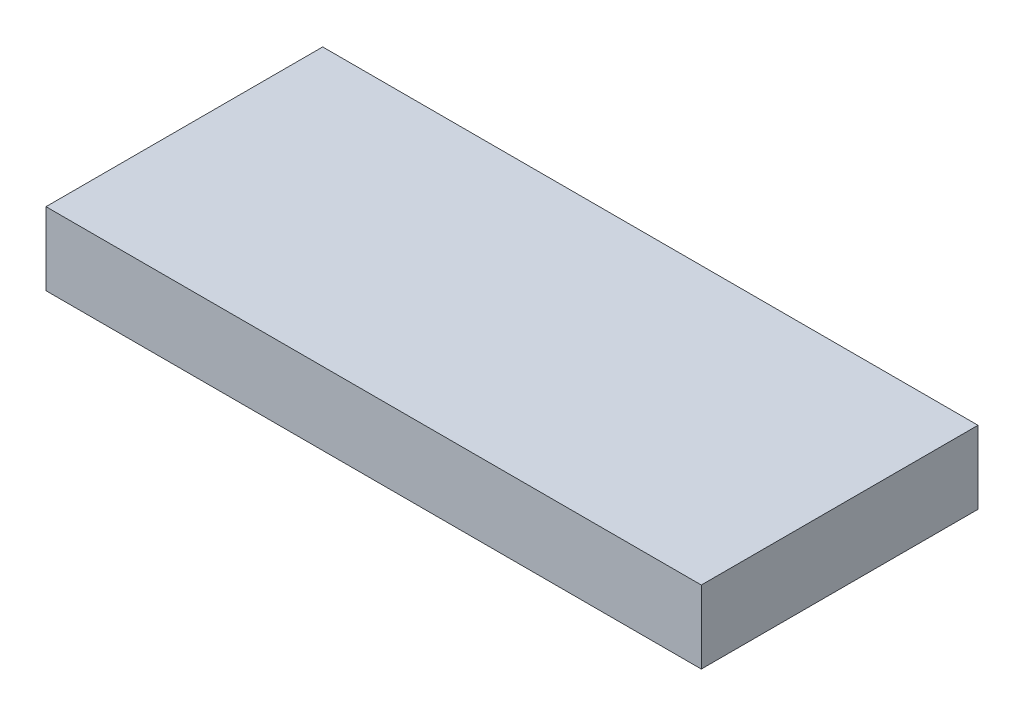
ISO-10303-21;
HEADER;
FILE_DESCRIPTION(('STEP AP214'),'2;1');
FILE_NAME('part.step','',(''),(''),'','','');
FILE_SCHEMA(('AUTOMOTIVE_DESIGN { 1 0 10303 214 1 1 1 1 }'));
ENDSEC;
DATA;
#1=APPLICATION_CONTEXT('core data for automotive mechanical design processes');
#2=APPLICATION_PROTOCOL_DEFINITION('international standard','automotive_design',2000,#1);
#3=PRODUCT_CONTEXT('',#1,'mechanical');
#4=PRODUCT('Part','Part','',(#3));
#5=PRODUCT_RELATED_PRODUCT_CATEGORY('part','',(#4));
#6=PRODUCT_DEFINITION_FORMATION('','',#4);
#7=PRODUCT_DEFINITION_CONTEXT('part definition',#1,'design');
#8=PRODUCT_DEFINITION('design','',#6,#7);
#9=PRODUCT_DEFINITION_SHAPE('','',#8);
#10=(LENGTH_UNIT() NAMED_UNIT(*) SI_UNIT(.MILLI.,.METRE.));
#11=(NAMED_UNIT(*) PLANE_ANGLE_UNIT() SI_UNIT($,.RADIAN.));
#12=(NAMED_UNIT(*) SI_UNIT($,.STERADIAN.) SOLID_ANGLE_UNIT());
#13=UNCERTAINTY_MEASURE_WITH_UNIT(LENGTH_MEASURE(1.E-05),#10,'distance_accuracy_value','');
#14=(GEOMETRIC_REPRESENTATION_CONTEXT(3) GLOBAL_UNCERTAINTY_ASSIGNED_CONTEXT((#13)) GLOBAL_UNIT_ASSIGNED_CONTEXT((#10,
#11,#12)) REPRESENTATION_CONTEXT('',''));
#15=CARTESIAN_POINT('',(0.,0.,0.));
#16=DIRECTION('',(0.,0.,1.));
#17=DIRECTION('',(1.,0.,0.));
#18=AXIS2_PLACEMENT_3D('',#15,#16,#17);
#19=CARTESIAN_POINT('',(0.,6.35,0.));
#20=DIRECTION('',(1.,0.,0.));
#21=DIRECTION('',(0.,0.,-1.));
#22=AXIS2_PLACEMENT_3D('',#19,#20,#21);
#23=PLANE('',#22);
#24=DIRECTION('',(0.,0.,1.));
#25=VECTOR('',#24,1.);
#26=CARTESIAN_POINT('',(0.,0.,0.));
#27=LINE('',#26,#25);
#28=CARTESIAN_POINT('',(0.,0.,0.));
#29=VERTEX_POINT('',#28);
#30=CARTESIAN_POINT('',(0.,0.,24.13));
#31=VERTEX_POINT('',#30);
#32=EDGE_CURVE('E100',#29,#31,#27,.T.);
#33=ORIENTED_EDGE('',*,*,#32,.T.);
#34=DIRECTION('',(0.,-1.,0.));
#35=VECTOR('',#34,1.);
#36=CARTESIAN_POINT('',(0.,6.35,24.13));
#37=LINE('',#36,#35);
#38=CARTESIAN_POINT('',(0.,6.35,24.13));
#39=VERTEX_POINT('',#38);
#40=EDGE_CURVE('E11',#39,#31,#37,.T.);
#41=ORIENTED_EDGE('',*,*,#40,.F.);
#42=DIRECTION('',(0.,0.,1.));
#43=VECTOR('',#42,1.);
#44=CARTESIAN_POINT('',(0.,6.35,0.));
#45=LINE('',#44,#43);
#46=CARTESIAN_POINT('',(0.,6.35,0.));
#47=VERTEX_POINT('',#46);
#48=EDGE_CURVE('E88',#47,#39,#45,.T.);
#49=ORIENTED_EDGE('',*,*,#48,.F.);
#50=DIRECTION('',(0.,-1.,0.));
#51=VECTOR('',#50,1.);
#52=CARTESIAN_POINT('',(0.,6.35,0.));
#53=LINE('',#52,#51);
#54=EDGE_CURVE('E96',#47,#29,#53,.T.);
#55=ORIENTED_EDGE('',*,*,#54,.T.);
#56=EDGE_LOOP('',(#33,#41,#49,#55));
#57=FACE_BOUND('',#56,.T.);
#58=ADVANCED_FACE('F37',(#57),#23,.F.);
#59=CARTESIAN_POINT('',(0.,6.35,24.13));
#60=DIRECTION('',(0.,0.,-1.));
#61=DIRECTION('',(-1.,0.,0.));
#62=AXIS2_PLACEMENT_3D('',#59,#60,#61);
#63=PLANE('',#62);
#64=DIRECTION('',(1.,0.,0.));
#65=VECTOR('',#64,1.);
#66=CARTESIAN_POINT('',(0.,0.,24.13));
#67=LINE('',#66,#65);
#68=CARTESIAN_POINT('',(57.15,0.,24.13));
#69=VERTEX_POINT('',#68);
#70=EDGE_CURVE('E92',#31,#69,#67,.T.);
#71=ORIENTED_EDGE('',*,*,#70,.T.);
#72=DIRECTION('',(0.,-1.,0.));
#73=VECTOR('',#72,1.);
#74=CARTESIAN_POINT('',(57.15,6.35,24.13));
#75=LINE('',#74,#73);
#76=CARTESIAN_POINT('',(57.15,6.35,24.13));
#77=VERTEX_POINT('',#76);
#78=EDGE_CURVE('E45',#77,#69,#75,.T.);
#79=ORIENTED_EDGE('',*,*,#78,.F.);
#80=DIRECTION('',(1.,0.,0.));
#81=VECTOR('',#80,1.);
#82=CARTESIAN_POINT('',(0.,6.35,24.13));
#83=LINE('',#82,#81);
#84=EDGE_CURVE('E83',#39,#77,#83,.T.);
#85=ORIENTED_EDGE('',*,*,#84,.F.);
#86=ORIENTED_EDGE('',*,*,#40,.T.);
#87=EDGE_LOOP('',(#71,#79,#85,#86));
#88=FACE_BOUND('',#87,.T.);
#89=ADVANCED_FACE('F91',(#88),#63,.F.);
#90=CARTESIAN_POINT('',(57.15,6.35,0.));
#91=DIRECTION('',(-1.,0.,0.));
#92=DIRECTION('',(0.,0.,1.));
#93=AXIS2_PLACEMENT_3D('',#90,#91,#92);
#94=PLANE('',#93);
#95=DIRECTION('',(0.,0.,-1.));
#96=VECTOR('',#95,1.);
#97=CARTESIAN_POINT('',(57.15,0.,0.));
#98=LINE('',#97,#96);
#99=CARTESIAN_POINT('',(57.15,0.,0.));
#100=VERTEX_POINT('',#99);
#101=EDGE_CURVE('E70',#69,#100,#98,.T.);
#102=ORIENTED_EDGE('',*,*,#101,.T.);
#103=DIRECTION('',(0.,-1.,0.));
#104=VECTOR('',#103,1.);
#105=CARTESIAN_POINT('',(57.15,6.35,0.));
#106=LINE('',#105,#104);
#107=CARTESIAN_POINT('',(57.15,6.35,0.));
#108=VERTEX_POINT('',#107);
#109=EDGE_CURVE('E93',#108,#100,#106,.T.);
#110=ORIENTED_EDGE('',*,*,#109,.F.);
#111=DIRECTION('',(0.,0.,-1.));
#112=VECTOR('',#111,1.);
#113=CARTESIAN_POINT('',(57.15,6.35,0.));
#114=LINE('',#113,#112);
#115=EDGE_CURVE('E86',#77,#108,#114,.T.);
#116=ORIENTED_EDGE('',*,*,#115,.F.);
#117=ORIENTED_EDGE('',*,*,#78,.T.);
#118=EDGE_LOOP('',(#102,#110,#116,#117));
#119=FACE_BOUND('',#118,.T.);
#120=ADVANCED_FACE('F94',(#119),#94,.F.);
#121=CARTESIAN_POINT('',(0.,6.35,0.));
#122=DIRECTION('',(0.,0.,1.));
#123=DIRECTION('',(1.,0.,0.));
#124=AXIS2_PLACEMENT_3D('',#121,#122,#123);
#125=PLANE('',#124);
#126=DIRECTION('',(-1.,0.,0.));
#127=VECTOR('',#126,1.);
#128=CARTESIAN_POINT('',(0.,0.,0.));
#129=LINE('',#128,#127);
#130=EDGE_CURVE('E76',#100,#29,#129,.T.);
#131=ORIENTED_EDGE('',*,*,#130,.T.);
#132=ORIENTED_EDGE('',*,*,#54,.F.);
#133=DIRECTION('',(-1.,0.,0.));
#134=VECTOR('',#133,1.);
#135=CARTESIAN_POINT('',(0.,6.35,0.));
#136=LINE('',#135,#134);
#137=EDGE_CURVE('E53',#108,#47,#136,.T.);
#138=ORIENTED_EDGE('',*,*,#137,.F.);
#139=ORIENTED_EDGE('',*,*,#109,.T.);
#140=EDGE_LOOP('',(#131,#132,#138,#139));
#141=FACE_BOUND('',#140,.T.);
#142=ADVANCED_FACE('F107',(#141),#125,.F.);
#143=CARTESIAN_POINT('',(0.,6.35,0.));
#144=DIRECTION('',(0.,1.,0.));
#145=DIRECTION('',(0.,0.,1.));
#146=AXIS2_PLACEMENT_3D('',#143,#144,#145);
#147=PLANE('',#146);
#148=ORIENTED_EDGE('',*,*,#48,.T.);
#149=ORIENTED_EDGE('',*,*,#84,.T.);
#150=ORIENTED_EDGE('',*,*,#115,.T.);
#151=ORIENTED_EDGE('',*,*,#137,.T.);
#152=EDGE_LOOP('',(#148,#149,#150,#151));
#153=FACE_BOUND('',#152,.T.);
#154=ADVANCED_FACE('F84',(#153),#147,.T.);
#155=CARTESIAN_POINT('',(0.,0.,0.));
#156=DIRECTION('',(0.,1.,0.));
#157=DIRECTION('',(0.,0.,1.));
#158=AXIS2_PLACEMENT_3D('',#155,#156,#157);
#159=PLANE('',#158);
#160=ORIENTED_EDGE('',*,*,#32,.F.);
#161=ORIENTED_EDGE('',*,*,#130,.F.);
#162=ORIENTED_EDGE('',*,*,#101,.F.);
#163=ORIENTED_EDGE('',*,*,#70,.F.);
#164=EDGE_LOOP('',(#160,#161,#162,#163));
#165=FACE_BOUND('',#164,.T.);
#166=ADVANCED_FACE('F110',(#165),#159,.F.);
#167=CLOSED_SHELL('',(#58,#89,#120,#142,#154,#166));
#168=MANIFOLD_SOLID_BREP('B2',#167);
#169=ADVANCED_BREP_SHAPE_REPRESENTATION('',(#18,#168),#14);
#170=SHAPE_DEFINITION_REPRESENTATION(#9,#169);
ENDSEC;
END-ISO-10303-21;
